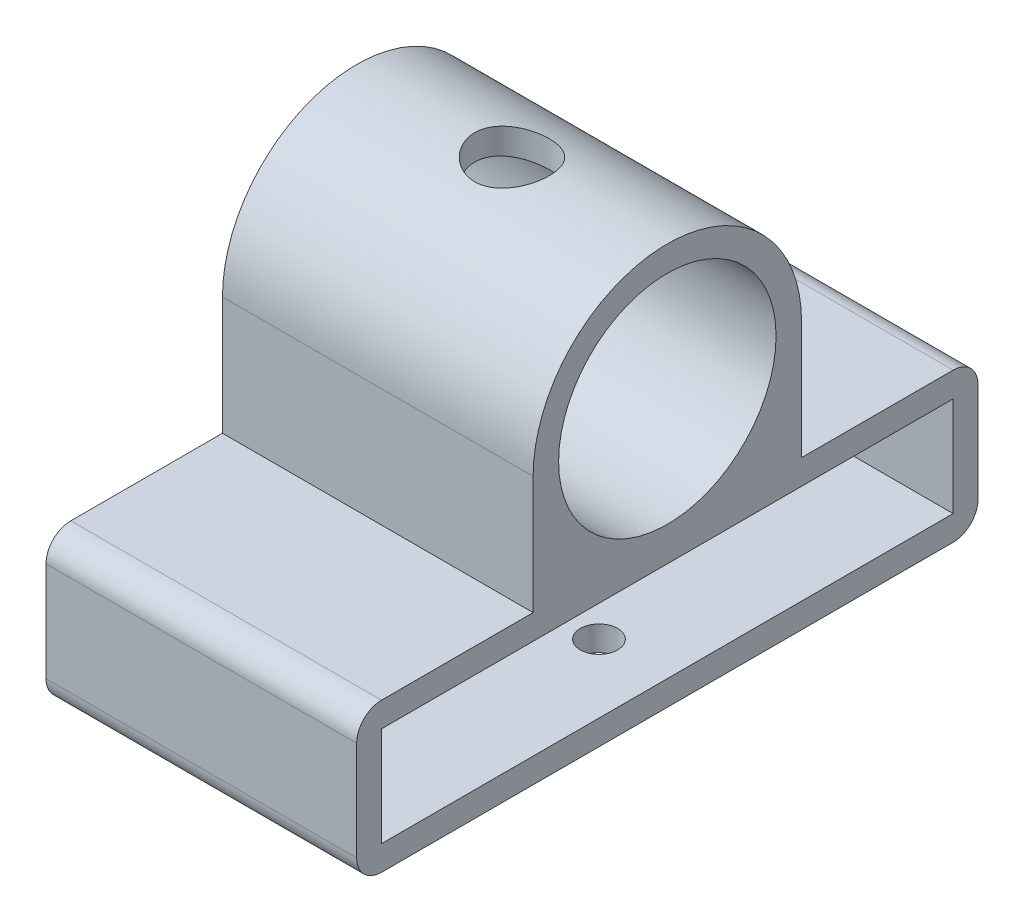
ISO-10303-21;
HEADER;
FILE_DESCRIPTION(('STEP AP214'),'2;1');
FILE_NAME('part.step','',(''),(''),'','','');
FILE_SCHEMA(('AUTOMOTIVE_DESIGN { 1 0 10303 214 1 1 1 1 }'));
ENDSEC;
DATA;
#1=APPLICATION_CONTEXT('core data for automotive mechanical design processes');
#2=APPLICATION_PROTOCOL_DEFINITION('international standard','automotive_design',2000,#1);
#3=PRODUCT_CONTEXT('',#1,'mechanical');
#4=PRODUCT('Part','Part','',(#3));
#5=PRODUCT_RELATED_PRODUCT_CATEGORY('part','',(#4));
#6=PRODUCT_DEFINITION_FORMATION('','',#4);
#7=PRODUCT_DEFINITION_CONTEXT('part definition',#1,'design');
#8=PRODUCT_DEFINITION('design','',#6,#7);
#9=PRODUCT_DEFINITION_SHAPE('','',#8);
#10=(LENGTH_UNIT() NAMED_UNIT(*) SI_UNIT(.MILLI.,.METRE.));
#11=(NAMED_UNIT(*) PLANE_ANGLE_UNIT() SI_UNIT($,.RADIAN.));
#12=(NAMED_UNIT(*) SI_UNIT($,.STERADIAN.) SOLID_ANGLE_UNIT());
#13=UNCERTAINTY_MEASURE_WITH_UNIT(LENGTH_MEASURE(1.E-05),#10,'distance_accuracy_value','');
#14=(GEOMETRIC_REPRESENTATION_CONTEXT(3) GLOBAL_UNCERTAINTY_ASSIGNED_CONTEXT((#13)) GLOBAL_UNIT_ASSIGNED_CONTEXT((#10,
#11,#12)) REPRESENTATION_CONTEXT('',''));
#15=CARTESIAN_POINT('',(0.,0.,0.));
#16=DIRECTION('',(0.,0.,1.));
#17=DIRECTION('',(1.,0.,0.));
#18=AXIS2_PLACEMENT_3D('',#15,#16,#17);
#19=CARTESIAN_POINT('',(25.,21.5,25.));
#20=DIRECTION('',(-1.,0.,0.));
#21=DIRECTION('',(0.,0.,1.));
#22=AXIS2_PLACEMENT_3D('',#19,#20,#21);
#23=CYLINDRICAL_SURFACE('',#22,10.8001020862543);
#24=CARTESIAN_POINT('',(12.5000000000001,31.8750761478417,28.0000000000001));
#25=CARTESIAN_POINT('',(12.3350155885734,31.8750787183999,27.9999965798171));
#26=CARTESIAN_POINT('',(12.169995975266,31.8790545621132,27.9863437179278));
#27=CARTESIAN_POINT('',(11.8447414079608,31.8944757751943,27.9322082668345));
#28=CARTESIAN_POINT('',(11.6845086245011,31.9059244808638,27.8917136938709));
#29=CARTESIAN_POINT('',(11.3735807147315,31.9348969362067,27.7853439097401));
#30=CARTESIAN_POINT('',(11.2228717857706,31.9524116441952,27.7195064572388));
#31=CARTESIAN_POINT('',(10.9346101969131,31.9915308922433,27.5644401098347));
#32=CARTESIAN_POINT('',(10.797058875036,32.013135847583,27.4752088394186));
#33=CARTESIAN_POINT('',(10.5352849825648,32.0586583544224,27.273297701562));
#34=CARTESIAN_POINT('',(10.4114722850632,32.0826196431922,27.1600961886337));
#35=CARTESIAN_POINT('',(10.1843222693024,32.1297787572401,26.9145785705975));
#36=CARTESIAN_POINT('',(10.0809872291158,32.1529764973367,26.7822603416454));
#37=CARTESIAN_POINT('',(9.89599407298968,32.1964856479089,26.499399514588));
#38=CARTESIAN_POINT('',(9.81474679240583,32.2167394662889,26.3485785969556));
#39=CARTESIAN_POINT('',(9.6789205212279,32.251574858852,26.0347594722937));
#40=CARTESIAN_POINT('',(9.6243366352327,32.2661574741682,25.8717635069443));
#41=CARTESIAN_POINT('',(9.54472269456855,32.2876980705764,25.5425027082269));
#42=CARTESIAN_POINT('',(9.51899462851516,32.2948358260574,25.376418620379));
#43=CARTESIAN_POINT('',(9.49562303720753,32.3013124875913,25.0421483592551));
#44=CARTESIAN_POINT('',(9.49797442729124,32.3006528056139,24.8739625720674));
#45=CARTESIAN_POINT('',(9.53021082714547,32.2917391565358,24.5451337946825));
#46=CARTESIAN_POINT('',(9.55934116202858,32.2836933511437,24.3844103080469));
#47=CARTESIAN_POINT('',(9.64308500545625,32.2611594597172,24.0702296506532));
#48=CARTESIAN_POINT('',(9.69770002568261,32.2466709915241,23.9167729115337));
#49=CARTESIAN_POINT('',(9.83141930044437,32.2125777264094,23.6195981248753));
#50=CARTESIAN_POINT('',(9.91077522974635,32.1929206901294,23.4759995627671));
#51=CARTESIAN_POINT('',(10.0915287695649,32.1505978956112,23.2039048528054));
#52=CARTESIAN_POINT('',(10.1929309874341,32.1279315088489,23.0754118704588));
#53=CARTESIAN_POINT('',(10.4188760456013,32.0811478300432,22.8326702960906));
#54=CARTESIAN_POINT('',(10.5440759217601,32.0570073535387,22.7190369933553));
#55=CARTESIAN_POINT('',(10.8120011453957,32.0106691828855,22.5142213879238));
#56=CARTESIAN_POINT('',(10.9547277568878,31.9884716290569,22.4230407059208));
#57=CARTESIAN_POINT('',(11.2550797802468,31.9484334364103,22.2651961821812));
#58=CARTESIAN_POINT('',(11.4128048502896,31.9306252401138,22.1987131577461));
#59=CARTESIAN_POINT('',(11.73781443011,31.9017781092757,22.0934158763361));
#60=CARTESIAN_POINT('',(11.9050963214743,31.8907373302034,22.0545940795343));
#61=CARTESIAN_POINT('',(12.2386835261567,31.8770719735564,22.0068103476323));
#62=CARTESIAN_POINT('',(12.4048460376407,31.8741872111129,21.9969249374616));
#63=CARTESIAN_POINT('',(12.7364526166109,31.8764461672175,22.0047390689627));
#64=CARTESIAN_POINT('',(12.9018967657777,31.8815889476871,22.0224353875026));
#65=CARTESIAN_POINT('',(13.2237196680102,31.8990708661425,22.0840936845918));
#66=CARTESIAN_POINT('',(13.3802164646619,31.9112543480163,22.1274880284844));
#67=CARTESIAN_POINT('',(13.6837068866621,31.9412898593181,22.2386660025095));
#68=CARTESIAN_POINT('',(13.8306991914499,31.959142674419,22.3064530132227));
#69=CARTESIAN_POINT('',(14.1148371518954,31.9990297793215,22.4663268668347));
#70=CARTESIAN_POINT('',(14.2516688104979,32.0211527583445,22.5589491133914));
#71=CARTESIAN_POINT('',(14.5081860903188,32.0668848260248,22.7652096650707));
#72=CARTESIAN_POINT('',(14.6278681956357,32.0904942179939,22.8788522687556));
#73=CARTESIAN_POINT('',(14.8505880483768,32.1374443923741,23.1282219452466));
#74=CARTESIAN_POINT('',(14.9529782813624,32.1607529626331,23.2645346646057));
#75=CARTESIAN_POINT('',(15.1334305071946,32.2037122697541,23.5529434365748));
#76=CARTESIAN_POINT('',(15.2114937890936,32.2233632004073,23.705038652322));
#77=CARTESIAN_POINT('',(15.3403406657101,32.2566667379078,24.0196292776999));
#78=CARTESIAN_POINT('',(15.3913303540835,32.2703645127391,24.1820352613639));
#79=CARTESIAN_POINT('',(15.465162363768,32.2904176451847,24.5135518233941));
#80=CARTESIAN_POINT('',(15.488011496827,32.2967747796629,24.6826607689965));
#81=CARTESIAN_POINT('',(15.5044571799266,32.3013385768293,25.0167556055226));
#82=CARTESIAN_POINT('',(15.4989998411874,32.2998088589372,25.1816919548555));
#83=CARTESIAN_POINT('',(15.4612051183568,32.2893750870671,25.5082042985256));
#84=CARTESIAN_POINT('',(15.4288689005151,32.2804713530409,25.6697804383474));
#85=CARTESIAN_POINT('',(15.3387868772895,32.2563499785412,25.9837456184701));
#86=CARTESIAN_POINT('',(15.2812473886737,32.241183660847,26.1361980615909));
#87=CARTESIAN_POINT('',(15.1425756773743,32.2061163313513,26.4293707547389));
#88=CARTESIAN_POINT('',(15.0614399397485,32.1862146142359,26.5700892528341));
#89=CARTESIAN_POINT('',(14.8751908952063,32.1430877390202,26.8401449320182));
#90=CARTESIAN_POINT('',(14.7694608820957,32.1197841131012,26.9690442005862));
#91=CARTESIAN_POINT('',(14.5381749952527,32.0727746554582,27.2075899888639));
#92=CARTESIAN_POINT('',(14.4126137616811,32.0490687165505,27.3172312866988));
#93=CARTESIAN_POINT('',(14.1415424910484,32.0032669722008,27.516813567753));
#94=CARTESIAN_POINT('',(13.9956201203861,31.9812246350646,27.6062079763751));
#95=CARTESIAN_POINT('',(13.690222811317,31.942029711655,27.7590737296155));
#96=CARTESIAN_POINT('',(13.5307560805264,31.9248741911257,27.8225606401644));
#97=CARTESIAN_POINT('',(13.226764011968,31.8995619084303,27.9143148555486));
#98=CARTESIAN_POINT('',(13.0834496121167,31.8904578756525,27.9463673358084));
#99=CARTESIAN_POINT('',(12.7934324424315,31.8782142636419,27.9892099624923));
#100=CARTESIAN_POINT('',(12.6467301428022,31.8750738616961,28.0000030417658));
#101=CARTESIAN_POINT('',(12.5000000000001,31.8750761478417,28.0000000000001));
#102=B_SPLINE_CURVE_WITH_KNOTS('',3,(#24,#25,#26,#27,#28,#29,#30,#31,#32,#33,#34,#35,#36,#37,
#38,#39,#40,#41,#42,#43,#44,#45,#46,#47,#48,#49,#50,#51,#52,#53,#54,#55,#56,#57,#58,#59,#60,#61,
#62,#63,#64,#65,#66,#67,#68,#69,#70,#71,#72,#73,#74,#75,#76,#77,#78,#79,#80,#81,#82,#83,#84,#85,
#86,#87,#88,#89,#90,#91,#92,#93,#94,#95,#96,#97,#98,#99,#100,#101),.UNSPECIFIED.,.T.,.F.,(4,2,2,
2,2,2,2,2,2,2,2,2,2,2,2,2,2,2,2,2,2,2,2,2,2,2,2,2,2,2,2,2,2,2,2,2,2,2,4),(0.,0.494413155498386,
0.989047195674237,1.48294710933213,1.97689719523962,2.48296759941219,2.98909427069793,
3.50407501358166,4.01896117039437,4.52110408464355,5.02315607162231,5.51147926901848,
5.99983143609351,6.493322998947,6.98691779363994,7.49691608688592,8.00695118245659,
8.52065002454314,9.03420879028583,9.53118892183343,10.0281109818814,10.514445890171,
11.0008482256144,11.4987223322804,11.9966983646011,12.5104524468465,13.0241793013216,
13.5339372898077,14.0435718611901,14.5362845308369,15.0289758232557,15.5177071427958,
16.0065113020056,16.5092273885045,17.0120795787255,17.5272136234034,18.0420377041921,
18.4818084824313,18.9215185876602),.UNSPECIFIED.);
#103=CARTESIAN_POINT('',(12.5000000000001,31.8750761478417,28.0000000000001));
#104=VERTEX_POINT('',#103);
#105=EDGE_CURVE('E215',#104,#104,#102,.T.);
#106=ORIENTED_EDGE('',*,*,#105,.T.);
#107=EDGE_LOOP('',(#106));
#108=FACE_BOUND('',#107,.T.);
#109=DIRECTION('',(1.,0.,0.));
#110=VECTOR('',#109,1.);
#111=CARTESIAN_POINT('',(1.21430643318376E-13,21.4999999999999,35.8001020862544));
#112=LINE('',#111,#110);
#113=CARTESIAN_POINT('',(1.21430643318376E-13,21.4999999999999,35.8001020862544));
#114=VERTEX_POINT('',#113);
#115=CARTESIAN_POINT('',(25.0000000000001,21.4999999999999,35.8001020862543));
#116=VERTEX_POINT('',#115);
#117=EDGE_CURVE('E480',#114,#116,#112,.T.);
#118=ORIENTED_EDGE('',*,*,#117,.T.);
#119=CARTESIAN_POINT('',(25.,21.5,25.));
#120=DIRECTION('',(1.,0.,0.));
#121=DIRECTION('',(0.,0.,-1.));
#122=AXIS2_PLACEMENT_3D('',#119,#120,#121);
#123=CIRCLE('',#122,10.8001020862543);
#124=CARTESIAN_POINT('',(25.,21.5,14.1998979137458));
#125=VERTEX_POINT('',#124);
#126=EDGE_CURVE('E425',#125,#116,#123,.T.);
#127=ORIENTED_EDGE('',*,*,#126,.F.);
#128=DIRECTION('',(1.,0.,0.));
#129=VECTOR('',#128,1.);
#130=CARTESIAN_POINT('',(0.,21.5,14.1998979137458));
#131=LINE('',#130,#129);
#132=CARTESIAN_POINT('',(0.,21.5,14.1998979137458));
#133=VERTEX_POINT('',#132);
#134=EDGE_CURVE('E396',#133,#125,#131,.T.);
#135=ORIENTED_EDGE('',*,*,#134,.F.);
#136=CARTESIAN_POINT('',(0.,21.5,25.));
#137=DIRECTION('',(1.,0.,0.));
#138=DIRECTION('',(0.,0.,-1.));
#139=AXIS2_PLACEMENT_3D('',#136,#137,#138);
#140=CIRCLE('',#139,10.8001020862543);
#141=EDGE_CURVE('E418',#133,#114,#140,.T.);
#142=ORIENTED_EDGE('',*,*,#141,.T.);
#143=EDGE_LOOP('',(#118,#127,#135,#142));
#144=FACE_BOUND('',#143,.T.);
#145=ADVANCED_FACE('F44',(#108,#144),#23,.T.);
#146=CARTESIAN_POINT('',(0.,12.,0.));
#147=DIRECTION('',(0.,-1.,0.));
#148=DIRECTION('',(0.,0.,-1.));
#149=AXIS2_PLACEMENT_3D('',#146,#147,#148);
#150=PLANE('',#149);
#151=DIRECTION('',(0.,0.,1.));
#152=VECTOR('',#151,1.);
#153=CARTESIAN_POINT('',(25.,12.,0.));
#154=LINE('',#153,#152);
#155=CARTESIAN_POINT('',(25.0000000000002,12.,48.));
#156=VERTEX_POINT('',#155);
#157=CARTESIAN_POINT('',(25.0000000000001,12.,35.8001020862543));
#158=VERTEX_POINT('',#157);
#159=EDGE_CURVE('E336',#156,#158,#154,.F.);
#160=ORIENTED_EDGE('',*,*,#159,.T.);
#161=DIRECTION('',(1.,0.,0.));
#162=VECTOR('',#161,1.);
#163=CARTESIAN_POINT('',(1.21430643318376E-13,12.,35.8001020862544));
#164=LINE('',#163,#162);
#165=CARTESIAN_POINT('',(1.21430643318376E-13,12.,35.8001020862544));
#166=VERTEX_POINT('',#165);
#167=EDGE_CURVE('E339',#166,#158,#164,.T.);
#168=ORIENTED_EDGE('',*,*,#167,.F.);
#169=DIRECTION('',(0.,0.,-1.));
#170=VECTOR('',#169,1.);
#171=CARTESIAN_POINT('',(0.,12.,0.));
#172=LINE('',#171,#170);
#173=CARTESIAN_POINT('',(1.64651951946517E-13,12.,48.));
#174=VERTEX_POINT('',#173);
#175=EDGE_CURVE('E380',#166,#174,#172,.F.);
#176=ORIENTED_EDGE('',*,*,#175,.T.);
#177=DIRECTION('',(1.,0.,0.));
#178=VECTOR('',#177,1.);
#179=CARTESIAN_POINT('',(0.,12.,48.));
#180=LINE('',#179,#178);
#181=EDGE_CURVE('E192',#156,#174,#180,.F.);
#182=ORIENTED_EDGE('',*,*,#181,.F.);
#183=EDGE_LOOP('',(#160,#168,#176,#182));
#184=FACE_BOUND('',#183,.T.);
#185=ADVANCED_FACE('F244',(#184),#150,.F.);
#186=CARTESIAN_POINT('',(12.5000000000001,0.,18.));
#187=DIRECTION('',(0.,1.,0.));
#188=DIRECTION('',(0.,0.,1.));
#189=AXIS2_PLACEMENT_3D('',#186,#187,#188);
#190=CYLINDRICAL_SURFACE('',#189,1.5);
#191=CARTESIAN_POINT('',(12.5000000000001,2.,18.));
#192=DIRECTION('',(0.,1.,0.));
#193=DIRECTION('',(0.,0.,1.));
#194=AXIS2_PLACEMENT_3D('',#191,#192,#193);
#195=CIRCLE('',#194,1.5);
#196=CARTESIAN_POINT('',(12.5000000000001,2.,19.5));
#197=VERTEX_POINT('',#196);
#198=EDGE_CURVE('E189',#197,#197,#195,.F.);
#199=ORIENTED_EDGE('',*,*,#198,.F.);
#200=EDGE_LOOP('',(#199));
#201=FACE_BOUND('',#200,.T.);
#202=CARTESIAN_POINT('',(12.5000000000001,0.,18.));
#203=DIRECTION('',(0.,1.,0.));
#204=DIRECTION('',(0.,0.,1.));
#205=AXIS2_PLACEMENT_3D('',#202,#203,#204);
#206=CIRCLE('',#205,1.5);
#207=CARTESIAN_POINT('',(12.5000000000001,0.,19.5));
#208=VERTEX_POINT('',#207);
#209=EDGE_CURVE('E205',#208,#208,#206,.F.);
#210=ORIENTED_EDGE('',*,*,#209,.T.);
#211=EDGE_LOOP('',(#210));
#212=FACE_BOUND('',#211,.T.);
#213=ADVANCED_FACE('F46',(#201,#212),#190,.F.);
#214=CARTESIAN_POINT('',(12.5000000000001,0.,25.));
#215=DIRECTION('',(0.,1.,0.));
#216=DIRECTION('',(0.,0.,1.));
#217=AXIS2_PLACEMENT_3D('',#214,#215,#216);
#218=CYLINDRICAL_SURFACE('',#217,4.);
#219=CARTESIAN_POINT('',(12.5000000000001,2.,25.));
#220=DIRECTION('',(0.,1.,0.));
#221=DIRECTION('',(0.,0.,1.));
#222=AXIS2_PLACEMENT_3D('',#219,#220,#221);
#223=CIRCLE('',#222,4.);
#224=CARTESIAN_POINT('',(12.5000000000001,2.,29.));
#225=VERTEX_POINT('',#224);
#226=EDGE_CURVE('E186',#225,#225,#223,.F.);
#227=ORIENTED_EDGE('',*,*,#226,.F.);
#228=EDGE_LOOP('',(#227));
#229=FACE_BOUND('',#228,.T.);
#230=CARTESIAN_POINT('',(12.5000000000001,0.,25.));
#231=DIRECTION('',(0.,1.,0.));
#232=DIRECTION('',(0.,0.,1.));
#233=AXIS2_PLACEMENT_3D('',#230,#231,#232);
#234=CIRCLE('',#233,4.);
#235=CARTESIAN_POINT('',(12.5000000000001,0.,29.));
#236=VERTEX_POINT('',#235);
#237=EDGE_CURVE('E202',#236,#236,#234,.F.);
#238=ORIENTED_EDGE('',*,*,#237,.T.);
#239=EDGE_LOOP('',(#238));
#240=FACE_BOUND('',#239,.T.);
#241=ADVANCED_FACE('F308',(#229,#240),#218,.F.);
#242=CARTESIAN_POINT('',(5.50000000000008,0.,25.));
#243=DIRECTION('',(0.,1.,0.));
#244=DIRECTION('',(0.,0.,1.));
#245=AXIS2_PLACEMENT_3D('',#242,#243,#244);
#246=CYLINDRICAL_SURFACE('',#245,1.5);
#247=CARTESIAN_POINT('',(5.50000000000008,2.,25.));
#248=DIRECTION('',(0.,1.,0.));
#249=DIRECTION('',(0.,0.,1.));
#250=AXIS2_PLACEMENT_3D('',#247,#248,#249);
#251=CIRCLE('',#250,1.5);
#252=CARTESIAN_POINT('',(5.50000000000008,2.,26.5));
#253=VERTEX_POINT('',#252);
#254=EDGE_CURVE('E183',#253,#253,#251,.F.);
#255=ORIENTED_EDGE('',*,*,#254,.F.);
#256=EDGE_LOOP('',(#255));
#257=FACE_BOUND('',#256,.T.);
#258=CARTESIAN_POINT('',(5.50000000000008,0.,25.));
#259=DIRECTION('',(0.,1.,0.));
#260=DIRECTION('',(0.,0.,1.));
#261=AXIS2_PLACEMENT_3D('',#258,#259,#260);
#262=CIRCLE('',#261,1.5);
#263=CARTESIAN_POINT('',(5.50000000000008,0.,26.5));
#264=VERTEX_POINT('',#263);
#265=EDGE_CURVE('E199',#264,#264,#262,.F.);
#266=ORIENTED_EDGE('',*,*,#265,.T.);
#267=EDGE_LOOP('',(#266));
#268=FACE_BOUND('',#267,.T.);
#269=ADVANCED_FACE('F305',(#257,#268),#246,.F.);
#270=CARTESIAN_POINT('',(12.5000000000001,0.,32.));
#271=DIRECTION('',(0.,1.,0.));
#272=DIRECTION('',(0.,0.,1.));
#273=AXIS2_PLACEMENT_3D('',#270,#271,#272);
#274=CYLINDRICAL_SURFACE('',#273,1.5);
#275=CARTESIAN_POINT('',(12.5000000000001,2.,32.));
#276=DIRECTION('',(0.,1.,0.));
#277=DIRECTION('',(0.,0.,1.));
#278=AXIS2_PLACEMENT_3D('',#275,#276,#277);
#279=CIRCLE('',#278,1.5);
#280=CARTESIAN_POINT('',(12.5000000000001,2.,33.5));
#281=VERTEX_POINT('',#280);
#282=EDGE_CURVE('E180',#281,#281,#279,.F.);
#283=ORIENTED_EDGE('',*,*,#282,.F.);
#284=EDGE_LOOP('',(#283));
#285=FACE_BOUND('',#284,.T.);
#286=CARTESIAN_POINT('',(12.5000000000001,0.,32.));
#287=DIRECTION('',(0.,1.,0.));
#288=DIRECTION('',(0.,0.,1.));
#289=AXIS2_PLACEMENT_3D('',#286,#287,#288);
#290=CIRCLE('',#289,1.5);
#291=CARTESIAN_POINT('',(12.5000000000001,0.,33.5));
#292=VERTEX_POINT('',#291);
#293=EDGE_CURVE('E196',#292,#292,#290,.F.);
#294=ORIENTED_EDGE('',*,*,#293,.T.);
#295=EDGE_LOOP('',(#294));
#296=FACE_BOUND('',#295,.T.);
#297=ADVANCED_FACE('F301',(#285,#296),#274,.F.);
#298=CARTESIAN_POINT('',(19.5000000000001,0.,25.));
#299=DIRECTION('',(0.,1.,0.));
#300=DIRECTION('',(0.,0.,1.));
#301=AXIS2_PLACEMENT_3D('',#298,#299,#300);
#302=CYLINDRICAL_SURFACE('',#301,1.5);
#303=CARTESIAN_POINT('',(19.5000000000001,2.,25.));
#304=DIRECTION('',(0.,1.,0.));
#305=DIRECTION('',(0.,0.,1.));
#306=AXIS2_PLACEMENT_3D('',#303,#304,#305);
#307=CIRCLE('',#306,1.5);
#308=CARTESIAN_POINT('',(19.5000000000001,2.,26.5));
#309=VERTEX_POINT('',#308);
#310=EDGE_CURVE('E173',#309,#309,#307,.F.);
#311=ORIENTED_EDGE('',*,*,#310,.F.);
#312=EDGE_LOOP('',(#311));
#313=FACE_BOUND('',#312,.T.);
#314=CARTESIAN_POINT('',(19.5000000000001,0.,25.));
#315=DIRECTION('',(0.,1.,0.));
#316=DIRECTION('',(0.,0.,1.));
#317=AXIS2_PLACEMENT_3D('',#314,#315,#316);
#318=CIRCLE('',#317,1.5);
#319=CARTESIAN_POINT('',(19.5000000000001,0.,26.5));
#320=VERTEX_POINT('',#319);
#321=EDGE_CURVE('E193',#320,#320,#318,.F.);
#322=ORIENTED_EDGE('',*,*,#321,.T.);
#323=EDGE_LOOP('',(#322));
#324=FACE_BOUND('',#323,.T.);
#325=ADVANCED_FACE('F297',(#313,#324),#302,.F.);
#326=CARTESIAN_POINT('',(0.,10.,2.));
#327=DIRECTION('',(-1.,0.,0.));
#328=DIRECTION('',(0.,0.,1.));
#329=AXIS2_PLACEMENT_3D('',#326,#327,#328);
#330=CYLINDRICAL_SURFACE('',#329,2.);
#331=CARTESIAN_POINT('',(0.,10.,2.));
#332=DIRECTION('',(-1.,0.,0.));
#333=DIRECTION('',(0.,0.,1.));
#334=AXIS2_PLACEMENT_3D('',#331,#332,#333);
#335=CIRCLE('',#334,2.);
#336=CARTESIAN_POINT('',(0.,10.,0.));
#337=VERTEX_POINT('',#336);
#338=CARTESIAN_POINT('',(0.,12.,2.));
#339=VERTEX_POINT('',#338);
#340=EDGE_CURVE('E383',#337,#339,#335,.F.);
#341=ORIENTED_EDGE('',*,*,#340,.T.);
#342=DIRECTION('',(1.,0.,0.));
#343=VECTOR('',#342,1.);
#344=CARTESIAN_POINT('',(0.,12.,2.));
#345=LINE('',#344,#343);
#346=CARTESIAN_POINT('',(25.,12.,2.));
#347=VERTEX_POINT('',#346);
#348=EDGE_CURVE('E386',#339,#347,#345,.T.);
#349=ORIENTED_EDGE('',*,*,#348,.T.);
#350=CARTESIAN_POINT('',(25.,10.,2.));
#351=DIRECTION('',(-1.,0.,0.));
#352=DIRECTION('',(0.,0.,1.));
#353=AXIS2_PLACEMENT_3D('',#350,#351,#352);
#354=CIRCLE('',#353,2.);
#355=CARTESIAN_POINT('',(25.,10.,0.));
#356=VERTEX_POINT('',#355);
#357=EDGE_CURVE('E364',#347,#356,#354,.T.);
#358=ORIENTED_EDGE('',*,*,#357,.T.);
#359=DIRECTION('',(1.,0.,0.));
#360=VECTOR('',#359,1.);
#361=CARTESIAN_POINT('',(0.,10.,0.));
#362=LINE('',#361,#360);
#363=EDGE_CURVE('E394',#356,#337,#362,.F.);
#364=ORIENTED_EDGE('',*,*,#363,.T.);
#365=EDGE_LOOP('',(#341,#349,#358,#364));
#366=FACE_BOUND('',#365,.T.);
#367=ADVANCED_FACE('F293',(#366),#330,.T.);
#368=CARTESIAN_POINT('',(0.,2.,0.));
#369=DIRECTION('',(0.,0.,1.));
#370=DIRECTION('',(1.,0.,0.));
#371=AXIS2_PLACEMENT_3D('',#368,#369,#370);
#372=PLANE('',#371);
#373=DIRECTION('',(-1.,0.,0.));
#374=VECTOR('',#373,1.);
#375=CARTESIAN_POINT('',(0.,2.,0.));
#376=LINE('',#375,#374);
#377=CARTESIAN_POINT('',(0.,2.,0.));
#378=VERTEX_POINT('',#377);
#379=CARTESIAN_POINT('',(25.,2.,0.));
#380=VERTEX_POINT('',#379);
#381=EDGE_CURVE('E207',#378,#380,#376,.F.);
#382=ORIENTED_EDGE('',*,*,#381,.F.);
#383=DIRECTION('',(0.,1.,0.));
#384=VECTOR('',#383,1.);
#385=CARTESIAN_POINT('',(0.,2.,0.));
#386=LINE('',#385,#384);
#387=EDGE_CURVE('E381',#378,#337,#386,.T.);
#388=ORIENTED_EDGE('',*,*,#387,.T.);
#389=ORIENTED_EDGE('',*,*,#363,.F.);
#390=DIRECTION('',(0.,1.,0.));
#391=VECTOR('',#390,1.);
#392=CARTESIAN_POINT('',(25.,2.,0.));
#393=LINE('',#392,#391);
#394=EDGE_CURVE('E361',#356,#380,#393,.F.);
#395=ORIENTED_EDGE('',*,*,#394,.T.);
#396=EDGE_LOOP('',(#382,#388,#389,#395));
#397=FACE_BOUND('',#396,.T.);
#398=ADVANCED_FACE('F289',(#397),#372,.F.);
#399=CARTESIAN_POINT('',(0.,2.,2.));
#400=DIRECTION('',(-1.,0.,0.));
#401=DIRECTION('',(0.,0.,1.));
#402=AXIS2_PLACEMENT_3D('',#399,#400,#401);
#403=CYLINDRICAL_SURFACE('',#402,2.);
#404=CARTESIAN_POINT('',(0.,2.,2.));
#405=DIRECTION('',(-1.,0.,0.));
#406=DIRECTION('',(0.,0.,1.));
#407=AXIS2_PLACEMENT_3D('',#404,#405,#406);
#408=CIRCLE('',#407,2.);
#409=CARTESIAN_POINT('',(0.,0.,2.));
#410=VERTEX_POINT('',#409);
#411=EDGE_CURVE('E167',#410,#378,#408,.F.);
#412=ORIENTED_EDGE('',*,*,#411,.T.);
#413=ORIENTED_EDGE('',*,*,#381,.T.);
#414=CARTESIAN_POINT('',(25.,2.,2.));
#415=DIRECTION('',(-1.,0.,0.));
#416=DIRECTION('',(0.,0.,1.));
#417=AXIS2_PLACEMENT_3D('',#414,#415,#416);
#418=CIRCLE('',#417,2.);
#419=CARTESIAN_POINT('',(25.,0.,2.));
#420=VERTEX_POINT('',#419);
#421=EDGE_CURVE('E360',#380,#420,#418,.T.);
#422=ORIENTED_EDGE('',*,*,#421,.T.);
#423=DIRECTION('',(1.,0.,0.));
#424=VECTOR('',#423,1.);
#425=CARTESIAN_POINT('',(0.,0.,2.));
#426=LINE('',#425,#424);
#427=EDGE_CURVE('E155',#420,#410,#426,.F.);
#428=ORIENTED_EDGE('',*,*,#427,.T.);
#429=EDGE_LOOP('',(#412,#413,#422,#428));
#430=FACE_BOUND('',#429,.T.);
#431=ADVANCED_FACE('F286',(#430),#403,.T.);
#432=CARTESIAN_POINT('',(0.,0.,0.));
#433=DIRECTION('',(0.,1.,0.));
#434=DIRECTION('',(0.,0.,1.));
#435=AXIS2_PLACEMENT_3D('',#432,#433,#434);
#436=PLANE('',#435);
#437=DIRECTION('',(1.,0.,0.));
#438=VECTOR('',#437,1.);
#439=CARTESIAN_POINT('',(1.71512449944288E-13,0.,48.));
#440=LINE('',#439,#438);
#441=CARTESIAN_POINT('',(1.68082200945403E-13,0.,48.));
#442=VERTEX_POINT('',#441);
#443=CARTESIAN_POINT('',(25.0000000000002,0.,48.));
#444=VERTEX_POINT('',#443);
#445=EDGE_CURVE('E143',#442,#444,#440,.T.);
#446=ORIENTED_EDGE('',*,*,#445,.F.);
#447=DIRECTION('',(0.,0.,-1.));
#448=VECTOR('',#447,1.);
#449=CARTESIAN_POINT('',(0.,0.,0.));
#450=LINE('',#449,#448);
#451=EDGE_CURVE('E147',#442,#410,#450,.T.);
#452=ORIENTED_EDGE('',*,*,#451,.T.);
#453=ORIENTED_EDGE('',*,*,#427,.F.);
#454=DIRECTION('',(0.,0.,1.));
#455=VECTOR('',#454,1.);
#456=CARTESIAN_POINT('',(25.,0.,0.));
#457=LINE('',#456,#455);
#458=EDGE_CURVE('E149',#420,#444,#457,.T.);
#459=ORIENTED_EDGE('',*,*,#458,.T.);
#460=EDGE_LOOP('',(#446,#452,#453,#459));
#461=FACE_BOUND('',#460,.T.);
#462=ORIENTED_EDGE('',*,*,#321,.F.);
#463=EDGE_LOOP('',(#462));
#464=FACE_BOUND('',#463,.T.);
#465=ORIENTED_EDGE('',*,*,#293,.F.);
#466=EDGE_LOOP('',(#465));
#467=FACE_BOUND('',#466,.T.);
#468=ORIENTED_EDGE('',*,*,#265,.F.);
#469=EDGE_LOOP('',(#468));
#470=FACE_BOUND('',#469,.T.);
#471=ORIENTED_EDGE('',*,*,#237,.F.);
#472=EDGE_LOOP('',(#471));
#473=FACE_BOUND('',#472,.T.);
#474=ORIENTED_EDGE('',*,*,#209,.F.);
#475=EDGE_LOOP('',(#474));
#476=FACE_BOUND('',#475,.T.);
#477=ADVANCED_FACE('F145',(#461,#464,#467,#470,#473,#476),#436,.F.);
#478=CARTESIAN_POINT('',(1.71512449944288E-13,2.,48.));
#479=DIRECTION('',(1.,0.,0.));
#480=DIRECTION('',(0.,0.,-1.));
#481=AXIS2_PLACEMENT_3D('',#478,#479,#480);
#482=CYLINDRICAL_SURFACE('',#481,2.);
#483=CARTESIAN_POINT('',(25.0000000000002,2.,48.));
#484=DIRECTION('',(1.,0.,0.));
#485=DIRECTION('',(0.,0.,-1.));
#486=AXIS2_PLACEMENT_3D('',#483,#484,#485);
#487=CIRCLE('',#486,2.);
#488=CARTESIAN_POINT('',(25.0000000000002,2.,50.));
#489=VERTEX_POINT('',#488);
#490=EDGE_CURVE('E358',#444,#489,#487,.F.);
#491=ORIENTED_EDGE('',*,*,#490,.T.);
#492=DIRECTION('',(-1.,0.,0.));
#493=VECTOR('',#492,1.);
#494=CARTESIAN_POINT('',(1.71512449944288E-13,2.,50.));
#495=LINE('',#494,#493);
#496=CARTESIAN_POINT('',(1.71512449944288E-13,2.,50.));
#497=VERTEX_POINT('',#496);
#498=EDGE_CURVE('E154',#489,#497,#495,.T.);
#499=ORIENTED_EDGE('',*,*,#498,.T.);
#500=CARTESIAN_POINT('',(1.71512449944288E-13,2.,48.));
#501=DIRECTION('',(1.,0.,0.));
#502=DIRECTION('',(0.,0.,-1.));
#503=AXIS2_PLACEMENT_3D('',#500,#501,#502);
#504=CIRCLE('',#503,2.);
#505=EDGE_CURVE('E163',#497,#442,#504,.T.);
#506=ORIENTED_EDGE('',*,*,#505,.T.);
#507=ORIENTED_EDGE('',*,*,#445,.T.);
#508=EDGE_LOOP('',(#491,#499,#506,#507));
#509=FACE_BOUND('',#508,.T.);
#510=ADVANCED_FACE('F169',(#509),#482,.T.);
#511=CARTESIAN_POINT('',(1.71512449944288E-13,2.,50.));
#512=DIRECTION('',(0.,0.,-1.));
#513=DIRECTION('',(-1.,0.,0.));
#514=AXIS2_PLACEMENT_3D('',#511,#512,#513);
#515=PLANE('',#514);
#516=DIRECTION('',(1.,0.,0.));
#517=VECTOR('',#516,1.);
#518=CARTESIAN_POINT('',(0.,10.,50.));
#519=LINE('',#518,#517);
#520=CARTESIAN_POINT('',(1.68082200945403E-13,10.,50.));
#521=VERTEX_POINT('',#520);
#522=CARTESIAN_POINT('',(25.0000000000002,10.,50.));
#523=VERTEX_POINT('',#522);
#524=EDGE_CURVE('E389',#521,#523,#519,.T.);
#525=ORIENTED_EDGE('',*,*,#524,.F.);
#526=DIRECTION('',(0.,1.,0.));
#527=VECTOR('',#526,1.);
#528=CARTESIAN_POINT('',(1.71512449944288E-13,2.,50.));
#529=LINE('',#528,#527);
#530=EDGE_CURVE('E376',#521,#497,#529,.F.);
#531=ORIENTED_EDGE('',*,*,#530,.T.);
#532=ORIENTED_EDGE('',*,*,#498,.F.);
#533=DIRECTION('',(0.,1.,0.));
#534=VECTOR('',#533,1.);
#535=CARTESIAN_POINT('',(25.0000000000002,2.,50.));
#536=LINE('',#535,#534);
#537=EDGE_CURVE('E355',#489,#523,#536,.T.);
#538=ORIENTED_EDGE('',*,*,#537,.T.);
#539=EDGE_LOOP('',(#525,#531,#532,#538));
#540=FACE_BOUND('',#539,.T.);
#541=ADVANCED_FACE('F277',(#540),#515,.F.);
#542=CARTESIAN_POINT('',(0.,10.,48.));
#543=DIRECTION('',(1.,0.,0.));
#544=DIRECTION('',(0.,0.,-1.));
#545=AXIS2_PLACEMENT_3D('',#542,#543,#544);
#546=CYLINDRICAL_SURFACE('',#545,2.);
#547=CARTESIAN_POINT('',(25.0000000000002,10.,48.));
#548=DIRECTION('',(1.,0.,0.));
#549=DIRECTION('',(0.,0.,-1.));
#550=AXIS2_PLACEMENT_3D('',#547,#548,#549);
#551=CIRCLE('',#550,2.);
#552=EDGE_CURVE('E352',#523,#156,#551,.F.);
#553=ORIENTED_EDGE('',*,*,#552,.T.);
#554=ORIENTED_EDGE('',*,*,#181,.T.);
#555=CARTESIAN_POINT('',(1.64651951946517E-13,10.,48.));
#556=DIRECTION('',(1.,0.,0.));
#557=DIRECTION('',(0.,0.,-1.));
#558=AXIS2_PLACEMENT_3D('',#555,#556,#557);
#559=CIRCLE('',#558,2.);
#560=EDGE_CURVE('E378',#174,#521,#559,.T.);
#561=ORIENTED_EDGE('',*,*,#560,.T.);
#562=ORIENTED_EDGE('',*,*,#524,.T.);
#563=EDGE_LOOP('',(#553,#554,#561,#562));
#564=FACE_BOUND('',#563,.T.);
#565=ADVANCED_FACE('F274',(#564),#546,.T.);
#566=CARTESIAN_POINT('',(0.,12.,14.1998979137458));
#567=VERTEX_POINT('',#566);
#568=EDGE_CURVE('E60',#339,#567,#172,.F.);
#569=ORIENTED_EDGE('',*,*,#568,.T.);
#570=DIRECTION('',(1.,0.,0.));
#571=VECTOR('',#570,1.);
#572=CARTESIAN_POINT('',(0.,12.,14.1998979137458));
#573=LINE('',#572,#571);
#574=CARTESIAN_POINT('',(25.,12.,14.1998979137458));
#575=VERTEX_POINT('',#574);
#576=EDGE_CURVE('E420',#567,#575,#573,.T.);
#577=ORIENTED_EDGE('',*,*,#576,.T.);
#578=EDGE_CURVE('E348',#575,#347,#154,.F.);
#579=ORIENTED_EDGE('',*,*,#578,.T.);
#580=ORIENTED_EDGE('',*,*,#348,.F.);
#581=EDGE_LOOP('',(#569,#577,#579,#580));
#582=FACE_BOUND('',#581,.T.);
#583=ADVANCED_FACE('F270',(#582),#150,.F.);
#584=CARTESIAN_POINT('',(0.,2.,0.));
#585=DIRECTION('',(0.,1.,0.));
#586=DIRECTION('',(0.,0.,1.));
#587=AXIS2_PLACEMENT_3D('',#584,#585,#586);
#588=PLANE('',#587);
#589=DIRECTION('',(0.,0.,-1.));
#590=VECTOR('',#589,1.);
#591=CARTESIAN_POINT('',(0.,2.,0.));
#592=LINE('',#591,#590);
#593=CARTESIAN_POINT('',(0.,2.,2.));
#594=VERTEX_POINT('',#593);
#595=CARTESIAN_POINT('',(1.2520408845933E-13,2.,48.));
#596=VERTEX_POINT('',#595);
#597=EDGE_CURVE('E171',#594,#596,#592,.F.);
#598=ORIENTED_EDGE('',*,*,#597,.T.);
#599=DIRECTION('',(1.,0.,0.));
#600=VECTOR('',#599,1.);
#601=CARTESIAN_POINT('',(1.64651951946517E-13,2.,48.));
#602=LINE('',#601,#600);
#603=CARTESIAN_POINT('',(25.0000000000002,2.,48.));
#604=VERTEX_POINT('',#603);
#605=EDGE_CURVE('E370',#596,#604,#602,.T.);
#606=ORIENTED_EDGE('',*,*,#605,.T.);
#607=DIRECTION('',(0.,0.,1.));
#608=VECTOR('',#607,1.);
#609=CARTESIAN_POINT('',(25.,2.,0.));
#610=LINE('',#609,#608);
#611=CARTESIAN_POINT('',(25.,2.,2.));
#612=VERTEX_POINT('',#611);
#613=EDGE_CURVE('E368',#604,#612,#610,.F.);
#614=ORIENTED_EDGE('',*,*,#613,.T.);
#615=DIRECTION('',(-1.,0.,0.));
#616=VECTOR('',#615,1.);
#617=CARTESIAN_POINT('',(0.,2.,2.));
#618=LINE('',#617,#616);
#619=EDGE_CURVE('E350',#612,#594,#618,.T.);
#620=ORIENTED_EDGE('',*,*,#619,.T.);
#621=EDGE_LOOP('',(#598,#606,#614,#620));
#622=FACE_BOUND('',#621,.T.);
#623=ORIENTED_EDGE('',*,*,#310,.T.);
#624=EDGE_LOOP('',(#623));
#625=FACE_BOUND('',#624,.T.);
#626=ORIENTED_EDGE('',*,*,#282,.T.);
#627=EDGE_LOOP('',(#626));
#628=FACE_BOUND('',#627,.T.);
#629=ORIENTED_EDGE('',*,*,#254,.T.);
#630=EDGE_LOOP('',(#629));
#631=FACE_BOUND('',#630,.T.);
#632=ORIENTED_EDGE('',*,*,#226,.T.);
#633=EDGE_LOOP('',(#632));
#634=FACE_BOUND('',#633,.T.);
#635=ORIENTED_EDGE('',*,*,#198,.T.);
#636=EDGE_LOOP('',(#635));
#637=FACE_BOUND('',#636,.T.);
#638=ADVANCED_FACE('F267',(#622,#625,#628,#631,#634,#637),#588,.T.);
#639=CARTESIAN_POINT('',(0.,2.,0.));
#640=DIRECTION('',(1.,0.,0.));
#641=DIRECTION('',(0.,0.,-1.));
#642=AXIS2_PLACEMENT_3D('',#639,#640,#641);
#643=PLANE('',#642);
#644=DIRECTION('',(0.,-1.,0.));
#645=VECTOR('',#644,1.);
#646=CARTESIAN_POINT('',(1.21430643318376E-13,21.4999999999999,35.8001020862544));
#647=LINE('',#646,#645);
#648=EDGE_CURVE('E239',#114,#166,#647,.T.);
#649=ORIENTED_EDGE('',*,*,#648,.F.);
#650=ORIENTED_EDGE('',*,*,#141,.F.);
#651=DIRECTION('',(0.,1.,0.));
#652=VECTOR('',#651,1.);
#653=CARTESIAN_POINT('',(0.,21.5,14.1998979137458));
#654=LINE('',#653,#652);
#655=EDGE_CURVE('E415',#567,#133,#654,.T.);
#656=ORIENTED_EDGE('',*,*,#655,.F.);
#657=ORIENTED_EDGE('',*,*,#568,.F.);
#658=ORIENTED_EDGE('',*,*,#340,.F.);
#659=ORIENTED_EDGE('',*,*,#387,.F.);
#660=ORIENTED_EDGE('',*,*,#411,.F.);
#661=ORIENTED_EDGE('',*,*,#451,.F.);
#662=ORIENTED_EDGE('',*,*,#505,.F.);
#663=ORIENTED_EDGE('',*,*,#530,.F.);
#664=ORIENTED_EDGE('',*,*,#560,.F.);
#665=ORIENTED_EDGE('',*,*,#175,.F.);
#666=EDGE_LOOP('',(#649,#650,#656,#657,#658,#659,#660,#661,#662,#663,#664,#665));
#667=FACE_BOUND('',#666,.T.);
#668=CARTESIAN_POINT('',(0.,21.5,25.));
#669=DIRECTION('',(1.,0.,0.));
#670=DIRECTION('',(0.,0.,-1.));
#671=AXIS2_PLACEMENT_3D('',#668,#669,#670);
#672=CIRCLE('',#671,8.75);
#673=CARTESIAN_POINT('',(0.,21.5,16.25));
#674=VERTEX_POINT('',#673);
#675=EDGE_CURVE('E482',#674,#674,#672,.T.);
#676=ORIENTED_EDGE('',*,*,#675,.T.);
#677=EDGE_LOOP('',(#676));
#678=FACE_BOUND('',#677,.T.);
#679=DIRECTION('',(0.,1.,0.));
#680=VECTOR('',#679,1.);
#681=CARTESIAN_POINT('',(1.64651951946517E-13,12.,48.));
#682=LINE('',#681,#680);
#683=CARTESIAN_POINT('',(1.2520408845933E-13,10.,48.));
#684=VERTEX_POINT('',#683);
#685=EDGE_CURVE('E373',#684,#596,#682,.F.);
#686=ORIENTED_EDGE('',*,*,#685,.T.);
#687=ORIENTED_EDGE('',*,*,#597,.F.);
#688=DIRECTION('',(0.,1.,0.));
#689=VECTOR('',#688,1.);
#690=CARTESIAN_POINT('',(0.,12.,2.));
#691=LINE('',#690,#689);
#692=CARTESIAN_POINT('',(0.,10.,2.));
#693=VERTEX_POINT('',#692);
#694=EDGE_CURVE('E441',#594,#693,#691,.T.);
#695=ORIENTED_EDGE('',*,*,#694,.T.);
#696=DIRECTION('',(0.,0.,1.));
#697=VECTOR('',#696,1.);
#698=CARTESIAN_POINT('',(0.,10.,0.));
#699=LINE('',#698,#697);
#700=EDGE_CURVE('E438',#693,#684,#699,.T.);
#701=ORIENTED_EDGE('',*,*,#700,.T.);
#702=EDGE_LOOP('',(#686,#687,#695,#701));
#703=FACE_BOUND('',#702,.T.);
#704=ADVANCED_FACE('F160',(#667,#678,#703),#643,.F.);
#705=CARTESIAN_POINT('',(1.64651951946517E-13,12.,48.));
#706=DIRECTION('',(0.,0.,1.));
#707=DIRECTION('',(1.,0.,0.));
#708=AXIS2_PLACEMENT_3D('',#705,#706,#707);
#709=PLANE('',#708);
#710=DIRECTION('',(0.,1.,0.));
#711=VECTOR('',#710,1.);
#712=CARTESIAN_POINT('',(25.0000000000002,2.,48.));
#713=LINE('',#712,#711);
#714=CARTESIAN_POINT('',(25.0000000000002,10.,48.));
#715=VERTEX_POINT('',#714);
#716=EDGE_CURVE('E365',#715,#604,#713,.F.);
#717=ORIENTED_EDGE('',*,*,#716,.T.);
#718=ORIENTED_EDGE('',*,*,#605,.F.);
#719=ORIENTED_EDGE('',*,*,#685,.F.);
#720=DIRECTION('',(1.,0.,0.));
#721=VECTOR('',#720,1.);
#722=CARTESIAN_POINT('',(0.,10.,48.));
#723=LINE('',#722,#721);
#724=EDGE_CURVE('E435',#684,#715,#723,.T.);
#725=ORIENTED_EDGE('',*,*,#724,.T.);
#726=EDGE_LOOP('',(#717,#718,#719,#725));
#727=FACE_BOUND('',#726,.T.);
#728=ADVANCED_FACE('F260',(#727),#709,.F.);
#729=CARTESIAN_POINT('',(25.,2.,0.));
#730=DIRECTION('',(-1.,0.,0.));
#731=DIRECTION('',(0.,0.,1.));
#732=AXIS2_PLACEMENT_3D('',#729,#730,#731);
#733=PLANE('',#732);
#734=ORIENTED_EDGE('',*,*,#126,.T.);
#735=DIRECTION('',(0.,-1.,0.));
#736=VECTOR('',#735,1.);
#737=CARTESIAN_POINT('',(25.0000000000001,21.4999999999999,35.8001020862543));
#738=LINE('',#737,#736);
#739=EDGE_CURVE('E238',#116,#158,#738,.T.);
#740=ORIENTED_EDGE('',*,*,#739,.T.);
#741=ORIENTED_EDGE('',*,*,#159,.F.);
#742=ORIENTED_EDGE('',*,*,#552,.F.);
#743=ORIENTED_EDGE('',*,*,#537,.F.);
#744=ORIENTED_EDGE('',*,*,#490,.F.);
#745=ORIENTED_EDGE('',*,*,#458,.F.);
#746=ORIENTED_EDGE('',*,*,#421,.F.);
#747=ORIENTED_EDGE('',*,*,#394,.F.);
#748=ORIENTED_EDGE('',*,*,#357,.F.);
#749=ORIENTED_EDGE('',*,*,#578,.F.);
#750=DIRECTION('',(0.,1.,0.));
#751=VECTOR('',#750,1.);
#752=CARTESIAN_POINT('',(25.,21.5,14.1998979137458));
#753=LINE('',#752,#751);
#754=EDGE_CURVE('E421',#575,#125,#753,.T.);
#755=ORIENTED_EDGE('',*,*,#754,.T.);
#756=EDGE_LOOP('',(#734,#740,#741,#742,#743,#744,#745,#746,#747,#748,#749,#755));
#757=FACE_BOUND('',#756,.T.);
#758=CARTESIAN_POINT('',(25.,21.5,25.));
#759=DIRECTION('',(1.,0.,0.));
#760=DIRECTION('',(0.,0.,-1.));
#761=AXIS2_PLACEMENT_3D('',#758,#759,#760);
#762=CIRCLE('',#761,8.75);
#763=CARTESIAN_POINT('',(25.,21.5,16.25));
#764=VERTEX_POINT('',#763);
#765=EDGE_CURVE('E484',#764,#764,#762,.T.);
#766=ORIENTED_EDGE('',*,*,#765,.F.);
#767=EDGE_LOOP('',(#766));
#768=FACE_BOUND('',#767,.T.);
#769=DIRECTION('',(0.,0.,1.));
#770=VECTOR('',#769,1.);
#771=CARTESIAN_POINT('',(25.0000000000002,10.,0.));
#772=LINE('',#771,#770);
#773=CARTESIAN_POINT('',(25.,10.,2.));
#774=VERTEX_POINT('',#773);
#775=EDGE_CURVE('E432',#715,#774,#772,.F.);
#776=ORIENTED_EDGE('',*,*,#775,.T.);
#777=DIRECTION('',(0.,1.,0.));
#778=VECTOR('',#777,1.);
#779=CARTESIAN_POINT('',(25.,12.,2.));
#780=LINE('',#779,#778);
#781=EDGE_CURVE('E69',#774,#612,#780,.F.);
#782=ORIENTED_EDGE('',*,*,#781,.T.);
#783=ORIENTED_EDGE('',*,*,#613,.F.);
#784=ORIENTED_EDGE('',*,*,#716,.F.);
#785=EDGE_LOOP('',(#776,#782,#783,#784));
#786=FACE_BOUND('',#785,.T.);
#787=ADVANCED_FACE('F257',(#757,#768,#786),#733,.F.);
#788=CARTESIAN_POINT('',(0.,12.,2.));
#789=DIRECTION('',(0.,0.,-1.));
#790=DIRECTION('',(-1.,0.,0.));
#791=AXIS2_PLACEMENT_3D('',#788,#789,#790);
#792=PLANE('',#791);
#793=ORIENTED_EDGE('',*,*,#694,.F.);
#794=ORIENTED_EDGE('',*,*,#619,.F.);
#795=ORIENTED_EDGE('',*,*,#781,.F.);
#796=DIRECTION('',(1.,0.,0.));
#797=VECTOR('',#796,1.);
#798=CARTESIAN_POINT('',(0.,10.,2.));
#799=LINE('',#798,#797);
#800=EDGE_CURVE('E53',#774,#693,#799,.F.);
#801=ORIENTED_EDGE('',*,*,#800,.T.);
#802=EDGE_LOOP('',(#793,#794,#795,#801));
#803=FACE_BOUND('',#802,.T.);
#804=ADVANCED_FACE('F253',(#803),#792,.F.);
#805=CARTESIAN_POINT('',(0.,10.,0.));
#806=DIRECTION('',(0.,1.,0.));
#807=DIRECTION('',(0.,0.,1.));
#808=AXIS2_PLACEMENT_3D('',#805,#806,#807);
#809=PLANE('',#808);
#810=ORIENTED_EDGE('',*,*,#775,.F.);
#811=ORIENTED_EDGE('',*,*,#724,.F.);
#812=ORIENTED_EDGE('',*,*,#700,.F.);
#813=ORIENTED_EDGE('',*,*,#800,.F.);
#814=EDGE_LOOP('',(#810,#811,#812,#813));
#815=FACE_BOUND('',#814,.T.);
#816=ADVANCED_FACE('F249',(#815),#809,.F.);
#817=CARTESIAN_POINT('',(0.,21.5,14.1998979137458));
#818=DIRECTION('',(0.,0.,-1.));
#819=DIRECTION('',(0.,1.,0.));
#820=AXIS2_PLACEMENT_3D('',#817,#818,#819);
#821=PLANE('',#820);
#822=ORIENTED_EDGE('',*,*,#754,.F.);
#823=ORIENTED_EDGE('',*,*,#576,.F.);
#824=ORIENTED_EDGE('',*,*,#655,.T.);
#825=ORIENTED_EDGE('',*,*,#134,.T.);
#826=EDGE_LOOP('',(#822,#823,#824,#825));
#827=FACE_BOUND('',#826,.T.);
#828=ADVANCED_FACE('F246',(#827),#821,.T.);
#829=CARTESIAN_POINT('',(0.,21.5,25.));
#830=DIRECTION('',(1.,0.,0.));
#831=DIRECTION('',(0.,0.,-1.));
#832=AXIS2_PLACEMENT_3D('',#829,#830,#831);
#833=CYLINDRICAL_SURFACE('',#832,8.75);
#834=CARTESIAN_POINT('',(12.5000000000001,29.7196411113868,28.0000000000001));
#835=CARTESIAN_POINT('',(12.6631026677264,29.719639666965,28.0000017880067));
#836=CARTESIAN_POINT('',(12.8261930090846,29.7245487931356,27.9866539214481));
#837=CARTESIAN_POINT('',(13.1475229389937,29.7435452903416,27.9338086663859));
#838=CARTESIAN_POINT('',(13.3057619546453,29.7576337410373,27.8943082018384));
#839=CARTESIAN_POINT('',(13.6126783509253,29.793209539162,27.7907236230069));
#840=CARTESIAN_POINT('',(13.7613746316123,29.8146816900074,27.7266899704479));
#841=CARTESIAN_POINT('',(14.0459647520904,29.8625829059431,27.5760306135623));
#842=CARTESIAN_POINT('',(14.1818555077828,29.8890131605888,27.4893994856652));
#843=CARTESIAN_POINT('',(14.442606039379,29.9450801533553,27.292160384091));
#844=CARTESIAN_POINT('',(14.5668585110533,29.9748001134384,27.1807730095453));
#845=CARTESIAN_POINT('',(14.7953371918526,30.0333964794457,26.9388445274943));
#846=CARTESIAN_POINT('',(14.8995599706963,30.0622727401615,26.8083001459032));
#847=CARTESIAN_POINT('',(15.0878130452085,30.116897275474,26.527285426899));
#848=CARTESIAN_POINT('',(15.1712018148212,30.1425363431768,26.3763622194535));
#849=CARTESIAN_POINT('',(15.3111646786476,30.1868128191416,26.0615995612838));
#850=CARTESIAN_POINT('',(15.3677464466487,30.2054522308118,25.8977638225904));
#851=CARTESIAN_POINT('',(15.450414408088,30.233039502447,25.5681981495993));
#852=CARTESIAN_POINT('',(15.4775420898004,30.2423174663587,25.4027576143362));
#853=CARTESIAN_POINT('',(15.503848963763,30.2513110578293,25.06942992644));
#854=CARTESIAN_POINT('',(15.5030357681163,30.2510292898045,24.9015434526276));
#855=CARTESIAN_POINT('',(15.4741327793624,30.2411558806093,24.5754815968107));
#856=CARTESIAN_POINT('',(15.447175366136,30.2319507433142,24.4171921928294));
#857=CARTESIAN_POINT('',(15.3686288000135,30.205754899992,24.1075376956295));
#858=CARTESIAN_POINT('',(15.3170379548663,30.1887636590835,23.9561730789083));
#859=CARTESIAN_POINT('',(15.1900584980085,30.148425012862,23.6622531791555));
#860=CARTESIAN_POINT('',(15.1143576296964,30.124994793543,23.5198446323989));
#861=CARTESIAN_POINT('',(14.9415680779829,30.0742024194193,23.2494255355054));
#862=CARTESIAN_POINT('',(14.8444732122199,30.0468391288459,23.1214191634436));
#863=CARTESIAN_POINT('',(14.6259988728825,29.9894485056728,22.8767135270174));
#864=CARTESIAN_POINT('',(14.5036533413405,29.9593563560944,22.7608906838024));
#865=CARTESIAN_POINT('',(14.2410338478009,29.9010316036662,22.5511121044852));
#866=CARTESIAN_POINT('',(14.1007567857006,29.872799323643,22.4571601574876));
#867=CARTESIAN_POINT('',(13.8033322988643,29.8210237711297,22.2924804943361));
#868=CARTESIAN_POINT('',(13.6459527022398,29.7975619198116,22.2221445217726));
#869=CARTESIAN_POINT('',(13.3205738756785,29.7589240212281,22.1092777690697));
#870=CARTESIAN_POINT('',(13.1525794450037,29.7437442588897,22.0667345203348));
#871=CARTESIAN_POINT('',(12.8192701933211,29.7242375940654,22.012490606235));
#872=CARTESIAN_POINT('',(12.6542059006266,29.7194303012082,21.9994233872597));
#873=CARTESIAN_POINT('',(12.3242081805409,29.7198660932533,22.0006154418051));
#874=CARTESIAN_POINT('',(12.1592747338794,29.7251072142708,22.0148693756179));
#875=CARTESIAN_POINT('',(11.8406032709186,29.7445683082343,22.0690684372425));
#876=CARTESIAN_POINT('',(11.6866768929379,29.7584481977845,22.1080415047684));
#877=CARTESIAN_POINT('',(11.3875871163843,29.7932423238922,22.2093938542848));
#878=CARTESIAN_POINT('',(11.2424253327739,29.8141578521977,22.271777434705));
#879=CARTESIAN_POINT('',(10.9596592391812,29.8615222933721,22.4205209383975));
#880=CARTESIAN_POINT('',(10.822463840889,29.88813137799,22.5076058051756));
#881=CARTESIAN_POINT('',(10.564141171528,29.9435834282031,22.7024696992645));
#882=CARTESIAN_POINT('',(10.4430189183966,29.9724270869883,22.8102551635939));
#883=CARTESIAN_POINT('',(10.2138442880212,30.0308903700107,23.0500309930809));
#884=CARTESIAN_POINT('',(10.1067829763373,30.0604737373572,23.1829803516578));
#885=CARTESIAN_POINT('',(9.91641366362057,30.1156309341645,23.4656873287901));
#886=CARTESIAN_POINT('',(9.83310497421835,30.1412048798117,23.6154444600678));
#887=CARTESIAN_POINT('',(9.69333621120368,30.1853598728658,23.9268828308828));
#888=CARTESIAN_POINT('',(9.63671475296287,30.2039828084466,24.0884853838713));
#889=CARTESIAN_POINT('',(9.55170590448694,30.2323142318632,24.4196883644161));
#890=CARTESIAN_POINT('',(9.52330766263178,30.2420261458112,24.5892856917481));
#891=CARTESIAN_POINT('',(9.4965720145566,30.2511678923419,24.9226242825561));
#892=CARTESIAN_POINT('',(9.49681552259973,30.251083116117,25.086239601543));
#893=CARTESIAN_POINT('',(9.52382305820706,30.2418515428223,25.4109897415497));
#894=CARTESIAN_POINT('',(9.55058472029075,30.2327055540337,25.5721247825142));
#895=CARTESIAN_POINT('',(9.6289125222775,30.2065676912877,25.8844998598383));
#896=CARTESIAN_POINT('',(9.68003339578264,30.1897168705443,26.0358642035901));
#897=CARTESIAN_POINT('',(9.80521024182898,30.1499064743703,26.3279171459297));
#898=CARTESIAN_POINT('',(9.87927043522402,30.1269457748265,26.4686037738727));
#899=CARTESIAN_POINT('',(10.0514762670169,30.0761737217924,26.7411793518459));
#900=CARTESIAN_POINT('',(10.1504346856282,30.0482104461305,26.8725260989779));
#901=CARTESIAN_POINT('',(10.3682685540707,29.9909215934873,27.1172081472939));
#902=CARTESIAN_POINT('',(10.4871505422868,29.9615955715798,27.2305375117833));
#903=CARTESIAN_POINT('',(10.7474316909771,29.9034080190188,27.4408301410186));
#904=CARTESIAN_POINT('',(10.8895678964296,29.8746179695137,27.5369039831997));
#905=CARTESIAN_POINT('',(11.1888732643181,29.8222531757539,27.7037537956032));
#906=CARTESIAN_POINT('',(11.3460395932919,29.7986774512657,27.7745345221852));
#907=CARTESIAN_POINT('',(11.6668972288272,29.7602597307172,27.8868787617009));
#908=CARTESIAN_POINT('',(11.8303134963923,29.7452070319357,27.9291525879652));
#909=CARTESIAN_POINT('',(12.1624923565161,29.7249004360638,27.9857066638909));
#910=CARTESIAN_POINT('',(12.331252775407,29.7196426057963,27.9999981501152));
#911=CARTESIAN_POINT('',(12.5000000000001,29.7196411113868,28.0000000000001));
#912=B_SPLINE_CURVE_WITH_KNOTS('',3,(#834,#835,#836,#837,#838,#839,#840,#841,#842,#843,#844,
#845,#846,#847,#848,#849,#850,#851,#852,#853,#854,#855,#856,#857,#858,#859,#860,#861,#862,#863,
#864,#865,#866,#867,#868,#869,#870,#871,#872,#873,#874,#875,#876,#877,#878,#879,#880,#881,#882,
#883,#884,#885,#886,#887,#888,#889,#890,#891,#892,#893,#894,#895,#896,#897,#898,#899,#900,#901,
#902,#903,#904,#905,#906,#907,#908,#909,#910,#911),.UNSPECIFIED.,.T.,.F.,(4,2,2,2,2,2,2,2,2,2,2,
2,2,2,2,2,2,2,2,2,2,2,2,2,2,2,2,2,2,2,2,2,2,2,2,2,2,2,4),(0.,0.488682337219745,
0.977422163006768,1.46516206218575,1.95301913062752,2.45922932278977,2.96552613130389,
3.48589073327405,4.00610628524081,4.5072593455663,5.00827587479767,5.48851853048441,
5.96879418230656,6.45556189842431,6.94247046386529,7.4535433316787,7.96470467641856,
8.48396864418948,9.00299949530806,9.49742441924309,9.99175272150507,10.4677544221134,
10.9438435647083,11.4356834532261,11.9276765317009,12.4449440528245,12.9621965816088,
13.4762796922962,13.9901650652326,14.4786007186932,14.9669928064889,15.446781266494,
15.9266580604689,16.4248866674341,16.9232791010886,17.4426450771838,17.9619133352713,
18.467710839701,18.9733051948578),.UNSPECIFIED.);
#913=CARTESIAN_POINT('',(12.5000000000001,29.7196411113868,28.0000000000001));
#914=VERTEX_POINT('',#913);
#915=EDGE_CURVE('E208',#914,#914,#912,.T.);
#916=ORIENTED_EDGE('',*,*,#915,.T.);
#917=EDGE_LOOP('',(#916));
#918=FACE_BOUND('',#917,.T.);
#919=ORIENTED_EDGE('',*,*,#765,.T.);
#920=EDGE_LOOP('',(#919));
#921=FACE_BOUND('',#920,.T.);
#922=ORIENTED_EDGE('',*,*,#675,.F.);
#923=EDGE_LOOP('',(#922));
#924=FACE_BOUND('',#923,.T.);
#925=ADVANCED_FACE('F217',(#918,#921,#924),#833,.F.);
#926=CARTESIAN_POINT('',(1.21430643318376E-13,21.4999999999999,35.8001020862544));
#927=DIRECTION('',(0.,0.,1.));
#928=DIRECTION('',(1.,0.,0.));
#929=AXIS2_PLACEMENT_3D('',#926,#927,#928);
#930=PLANE('',#929);
#931=ORIENTED_EDGE('',*,*,#739,.F.);
#932=ORIENTED_EDGE('',*,*,#117,.F.);
#933=ORIENTED_EDGE('',*,*,#648,.T.);
#934=ORIENTED_EDGE('',*,*,#167,.T.);
#935=EDGE_LOOP('',(#931,#932,#933,#934));
#936=FACE_BOUND('',#935,.T.);
#937=ADVANCED_FACE('F225',(#936),#930,.T.);
#938=CARTESIAN_POINT('',(12.5000000000001,11.9999,25.0000000000001));
#939=DIRECTION('',(0.,1.,0.));
#940=DIRECTION('',(0.,0.,1.));
#941=AXIS2_PLACEMENT_3D('',#938,#939,#940);
#942=CYLINDRICAL_SURFACE('',#941,3.);
#943=ORIENTED_EDGE('',*,*,#915,.F.);
#944=EDGE_LOOP('',(#943));
#945=FACE_BOUND('',#944,.T.);
#946=ORIENTED_EDGE('',*,*,#105,.F.);
#947=EDGE_LOOP('',(#946));
#948=FACE_BOUND('',#947,.T.);
#949=ADVANCED_FACE('F221',(#945,#948),#942,.F.);
#950=CLOSED_SHELL('',(#145,#185,#213,#241,#269,#297,#325,#367,#398,#431,#477,#510,#541,#565,
#583,#638,#704,#728,#787,#804,#816,#828,#925,#937,#949));
#951=CARTESIAN_POINT('',(12.5000000000001,12.,25.0000000000001));
#952=DIRECTION('',(0.,1.,0.));
#953=DIRECTION('',(0.,0.,1.));
#954=AXIS2_PLACEMENT_3D('',#951,#952,#953);
#955=PLANE('',#954);
#956=CARTESIAN_POINT('',(12.5000000000001,12.,25.0000000000001));
#957=DIRECTION('',(0.,1.,0.));
#958=DIRECTION('',(0.,0.,1.));
#959=AXIS2_PLACEMENT_3D('',#956,#957,#958);
#960=CIRCLE('',#959,3.);
#961=CARTESIAN_POINT('',(12.5000000000001,12.,28.0000000000001));
#962=VERTEX_POINT('',#961);
#963=EDGE_CURVE('E11',#962,#962,#960,.F.);
#964=ORIENTED_EDGE('',*,*,#963,.T.);
#965=EDGE_LOOP('',(#964));
#966=FACE_BOUND('',#965,.T.);
#967=ADVANCED_FACE('F513',(#966),#955,.F.);
#968=CARTESIAN_POINT('',(12.5000000000001,11.9999,25.0000000000001));
#969=DIRECTION('',(0.,1.,0.));
#970=DIRECTION('',(0.,0.,1.));
#971=AXIS2_PLACEMENT_3D('',#968,#969,#970);
#972=PLANE('',#971);
#973=CARTESIAN_POINT('',(12.5000000000001,11.9999,25.0000000000001));
#974=DIRECTION('',(0.,1.,0.));
#975=DIRECTION('',(0.,0.,1.));
#976=AXIS2_PLACEMENT_3D('',#973,#974,#975);
#977=CIRCLE('',#976,3.);
#978=CARTESIAN_POINT('',(12.5000000000001,11.9999,28.0000000000001));
#979=VERTEX_POINT('',#978);
#980=EDGE_CURVE('E216',#979,#979,#977,.T.);
#981=ORIENTED_EDGE('',*,*,#980,.T.);
#982=EDGE_LOOP('',(#981));
#983=FACE_BOUND('',#982,.T.);
#984=ADVANCED_FACE('F228',(#983),#972,.T.);
#985=ORIENTED_EDGE('',*,*,#980,.F.);
#986=EDGE_LOOP('',(#985));
#987=FACE_BOUND('',#986,.T.);
#988=ORIENTED_EDGE('',*,*,#963,.F.);
#989=EDGE_LOOP('',(#988));
#990=FACE_BOUND('',#989,.T.);
#991=ADVANCED_FACE('F227',(#987,#990),#942,.F.);
#992=CLOSED_SHELL('',(#967,#984,#991));
#993=ORIENTED_CLOSED_SHELL('',*,#992,.T.);
#994=BREP_WITH_VOIDS('B2',#950,(#993));
#995=ADVANCED_BREP_SHAPE_REPRESENTATION('',(#18,#994),#14);
#996=SHAPE_DEFINITION_REPRESENTATION(#9,#995);
ENDSEC;
END-ISO-10303-21;
